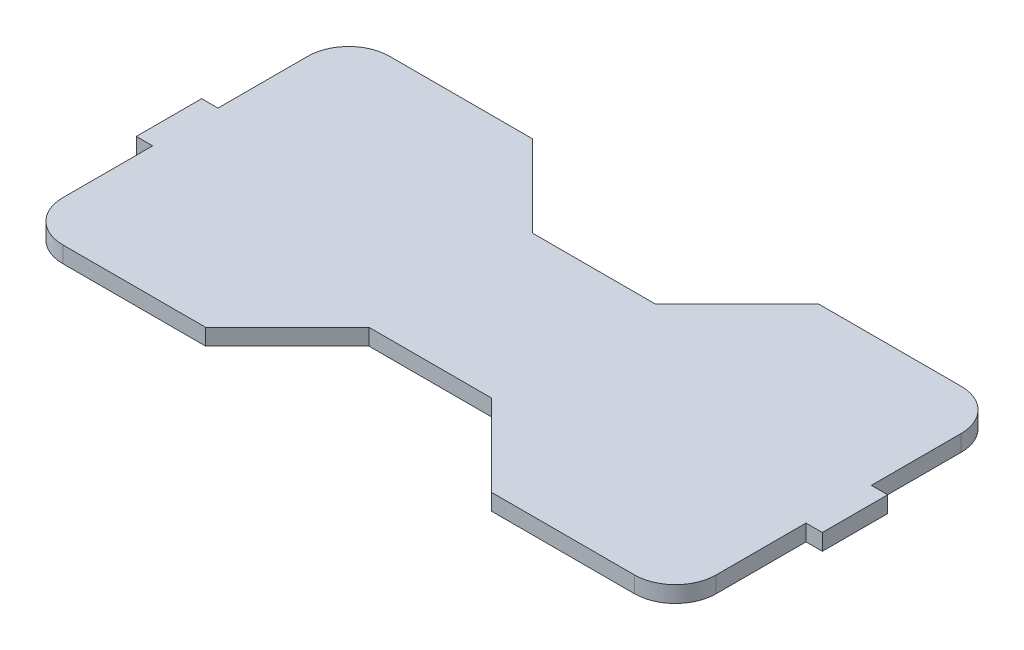
ISO-10303-21;
HEADER;
FILE_DESCRIPTION(('STEP AP214'),'2;1');
FILE_NAME('part.step','',(''),(''),'','','');
FILE_SCHEMA(('AUTOMOTIVE_DESIGN { 1 0 10303 214 1 1 1 1 }'));
ENDSEC;
DATA;
#1=APPLICATION_CONTEXT('core data for automotive mechanical design processes');
#2=APPLICATION_PROTOCOL_DEFINITION('international standard','automotive_design',2000,#1);
#3=PRODUCT_CONTEXT('',#1,'mechanical');
#4=PRODUCT('Part','Part','',(#3));
#5=PRODUCT_RELATED_PRODUCT_CATEGORY('part','',(#4));
#6=PRODUCT_DEFINITION_FORMATION('','',#4);
#7=PRODUCT_DEFINITION_CONTEXT('part definition',#1,'design');
#8=PRODUCT_DEFINITION('design','',#6,#7);
#9=PRODUCT_DEFINITION_SHAPE('','',#8);
#10=(LENGTH_UNIT() NAMED_UNIT(*) SI_UNIT(.MILLI.,.METRE.));
#11=(NAMED_UNIT(*) PLANE_ANGLE_UNIT() SI_UNIT($,.RADIAN.));
#12=(NAMED_UNIT(*) SI_UNIT($,.STERADIAN.) SOLID_ANGLE_UNIT());
#13=UNCERTAINTY_MEASURE_WITH_UNIT(LENGTH_MEASURE(1.E-05),#10,'distance_accuracy_value','');
#14=(GEOMETRIC_REPRESENTATION_CONTEXT(3) GLOBAL_UNCERTAINTY_ASSIGNED_CONTEXT((#13)) GLOBAL_UNIT_ASSIGNED_CONTEXT((#10,
#11,#12)) REPRESENTATION_CONTEXT('',''));
#15=CARTESIAN_POINT('',(0.,0.,0.));
#16=DIRECTION('',(0.,0.,1.));
#17=DIRECTION('',(1.,0.,0.));
#18=AXIS2_PLACEMENT_3D('',#15,#16,#17);
#19=CARTESIAN_POINT('',(-9.525,2.54,-12.7));
#20=DIRECTION('',(-0.707106781186549,0.,0.707106781186546));
#21=DIRECTION('',(0.707106781186546,0.,0.707106781186549));
#22=AXIS2_PLACEMENT_3D('',#19,#20,#21);
#23=PLANE('',#22);
#24=DIRECTION('',(-0.707106781186546,0.,-0.707106781186549));
#25=VECTOR('',#24,1.);
#26=CARTESIAN_POINT('',(-9.525,0.,-12.7));
#27=LINE('',#26,#25);
#28=CARTESIAN_POINT('',(-9.525,0.,-12.7));
#29=VERTEX_POINT('',#28);
#30=CARTESIAN_POINT('',(-22.225,0.,-25.4));
#31=VERTEX_POINT('',#30);
#32=EDGE_CURVE('E222',#29,#31,#27,.T.);
#33=ORIENTED_EDGE('',*,*,#32,.T.);
#34=DIRECTION('',(0.,-1.,0.));
#35=VECTOR('',#34,1.);
#36=CARTESIAN_POINT('',(-22.225,2.54,-25.4));
#37=LINE('',#36,#35);
#38=CARTESIAN_POINT('',(-22.225,2.54,-25.4));
#39=VERTEX_POINT('',#38);
#40=EDGE_CURVE('E203',#39,#31,#37,.T.);
#41=ORIENTED_EDGE('',*,*,#40,.F.);
#42=DIRECTION('',(-0.707106781186546,0.,-0.707106781186549));
#43=VECTOR('',#42,1.);
#44=CARTESIAN_POINT('',(-9.525,2.54,-12.7));
#45=LINE('',#44,#43);
#46=CARTESIAN_POINT('',(-9.525,2.54,-12.7));
#47=VERTEX_POINT('',#46);
#48=EDGE_CURVE('E209',#47,#39,#45,.T.);
#49=ORIENTED_EDGE('',*,*,#48,.F.);
#50=DIRECTION('',(0.,-1.,0.));
#51=VECTOR('',#50,1.);
#52=CARTESIAN_POINT('',(-9.525,2.54,-12.7));
#53=LINE('',#52,#51);
#54=EDGE_CURVE('E310',#47,#29,#53,.T.);
#55=ORIENTED_EDGE('',*,*,#54,.T.);
#56=EDGE_LOOP('',(#33,#41,#49,#55));
#57=FACE_BOUND('',#56,.T.);
#58=ADVANCED_FACE('F36',(#57),#23,.F.);
#59=CARTESIAN_POINT('',(-22.225,2.54,-25.4));
#60=DIRECTION('',(0.,0.,1.));
#61=DIRECTION('',(1.,0.,0.));
#62=AXIS2_PLACEMENT_3D('',#59,#60,#61);
#63=PLANE('',#62);
#64=DIRECTION('',(-1.,0.,0.));
#65=VECTOR('',#64,1.);
#66=CARTESIAN_POINT('',(-22.225,0.,-25.4));
#67=LINE('',#66,#65);
#68=CARTESIAN_POINT('',(-44.45,0.,-25.4));
#69=VERTEX_POINT('',#68);
#70=EDGE_CURVE('E362',#31,#69,#67,.T.);
#71=ORIENTED_EDGE('',*,*,#70,.T.);
#72=DIRECTION('',(0.,-1.,0.));
#73=VECTOR('',#72,1.);
#74=CARTESIAN_POINT('',(-44.45,2.54,-25.4));
#75=LINE('',#74,#73);
#76=CARTESIAN_POINT('',(-44.45,2.54,-25.4));
#77=VERTEX_POINT('',#76);
#78=EDGE_CURVE('E206',#69,#77,#75,.F.);
#79=ORIENTED_EDGE('',*,*,#78,.T.);
#80=DIRECTION('',(-1.,0.,0.));
#81=VECTOR('',#80,1.);
#82=CARTESIAN_POINT('',(-22.225,2.54,-25.4));
#83=LINE('',#82,#81);
#84=EDGE_CURVE('E198',#39,#77,#83,.T.);
#85=ORIENTED_EDGE('',*,*,#84,.F.);
#86=ORIENTED_EDGE('',*,*,#40,.T.);
#87=EDGE_LOOP('',(#71,#79,#85,#86));
#88=FACE_BOUND('',#87,.T.);
#89=ADVANCED_FACE('F201',(#88),#63,.F.);
#90=CARTESIAN_POINT('',(-50.8,2.54,-25.4));
#91=DIRECTION('',(1.,0.,0.));
#92=DIRECTION('',(0.,0.,-1.));
#93=AXIS2_PLACEMENT_3D('',#90,#91,#92);
#94=PLANE('',#93);
#95=DIRECTION('',(0.,0.,1.));
#96=VECTOR('',#95,1.);
#97=CARTESIAN_POINT('',(-50.8,2.54,-25.4));
#98=LINE('',#97,#96);
#99=CARTESIAN_POINT('',(-50.8,2.54,-19.05));
#100=VERTEX_POINT('',#99);
#101=CARTESIAN_POINT('',(-50.8,2.54,-5.07999999999999));
#102=VERTEX_POINT('',#101);
#103=EDGE_CURVE('E208',#100,#102,#98,.T.);
#104=ORIENTED_EDGE('',*,*,#103,.F.);
#105=DIRECTION('',(0.,-1.,0.));
#106=VECTOR('',#105,1.);
#107=CARTESIAN_POINT('',(-50.8,2.54,-19.05));
#108=LINE('',#107,#106);
#109=CARTESIAN_POINT('',(-50.8,0.,-19.05));
#110=VERTEX_POINT('',#109);
#111=EDGE_CURVE('E254',#100,#110,#108,.T.);
#112=ORIENTED_EDGE('',*,*,#111,.T.);
#113=DIRECTION('',(0.,0.,1.));
#114=VECTOR('',#113,1.);
#115=CARTESIAN_POINT('',(-50.8,0.,-25.4));
#116=LINE('',#115,#114);
#117=CARTESIAN_POINT('',(-50.8,0.,-5.07999999999999));
#118=VERTEX_POINT('',#117);
#119=EDGE_CURVE('E358',#110,#118,#116,.T.);
#120=ORIENTED_EDGE('',*,*,#119,.T.);
#121=DIRECTION('',(0.,-1.,0.));
#122=VECTOR('',#121,1.);
#123=CARTESIAN_POINT('',(-50.8,2.54,-5.07999999999999));
#124=LINE('',#123,#122);
#125=EDGE_CURVE('E224',#102,#118,#124,.T.);
#126=ORIENTED_EDGE('',*,*,#125,.F.);
#127=EDGE_LOOP('',(#104,#112,#120,#126));
#128=FACE_BOUND('',#127,.T.);
#129=ADVANCED_FACE('F406',(#128),#94,.F.);
#130=CARTESIAN_POINT('',(-50.8,2.54,-5.07999999999999));
#131=DIRECTION('',(0.,0.,1.));
#132=DIRECTION('',(1.,0.,0.));
#133=AXIS2_PLACEMENT_3D('',#130,#131,#132);
#134=PLANE('',#133);
#135=DIRECTION('',(-1.,0.,0.));
#136=VECTOR('',#135,1.);
#137=CARTESIAN_POINT('',(-50.8,0.,-5.07999999999999));
#138=LINE('',#137,#136);
#139=CARTESIAN_POINT('',(-53.34,0.,-5.07999999999999));
#140=VERTEX_POINT('',#139);
#141=EDGE_CURVE('E355',#118,#140,#138,.T.);
#142=ORIENTED_EDGE('',*,*,#141,.T.);
#143=DIRECTION('',(0.,-1.,0.));
#144=VECTOR('',#143,1.);
#145=CARTESIAN_POINT('',(-53.34,2.54,-5.07999999999999));
#146=LINE('',#145,#144);
#147=CARTESIAN_POINT('',(-53.34,2.54,-5.07999999999999));
#148=VERTEX_POINT('',#147);
#149=EDGE_CURVE('E230',#148,#140,#146,.T.);
#150=ORIENTED_EDGE('',*,*,#149,.F.);
#151=DIRECTION('',(-1.,0.,0.));
#152=VECTOR('',#151,1.);
#153=CARTESIAN_POINT('',(-50.8,2.54,-5.07999999999999));
#154=LINE('',#153,#152);
#155=EDGE_CURVE('E400',#102,#148,#154,.T.);
#156=ORIENTED_EDGE('',*,*,#155,.F.);
#157=ORIENTED_EDGE('',*,*,#125,.T.);
#158=EDGE_LOOP('',(#142,#150,#156,#157));
#159=FACE_BOUND('',#158,.T.);
#160=ADVANCED_FACE('F407',(#159),#134,.F.);
#161=CARTESIAN_POINT('',(-53.34,2.54,-5.07999999999999));
#162=DIRECTION('',(1.,0.,0.));
#163=DIRECTION('',(0.,0.,-1.));
#164=AXIS2_PLACEMENT_3D('',#161,#162,#163);
#165=PLANE('',#164);
#166=DIRECTION('',(0.,0.,1.));
#167=VECTOR('',#166,1.);
#168=CARTESIAN_POINT('',(-53.34,0.,-5.07999999999999));
#169=LINE('',#168,#167);
#170=CARTESIAN_POINT('',(-53.34,0.,5.07999999999999));
#171=VERTEX_POINT('',#170);
#172=EDGE_CURVE('E348',#140,#171,#169,.T.);
#173=ORIENTED_EDGE('',*,*,#172,.T.);
#174=DIRECTION('',(0.,-1.,0.));
#175=VECTOR('',#174,1.);
#176=CARTESIAN_POINT('',(-53.34,2.54,5.07999999999999));
#177=LINE('',#176,#175);
#178=CARTESIAN_POINT('',(-53.34,2.54,5.07999999999999));
#179=VERTEX_POINT('',#178);
#180=EDGE_CURVE('E339',#179,#171,#177,.T.);
#181=ORIENTED_EDGE('',*,*,#180,.F.);
#182=DIRECTION('',(0.,0.,1.));
#183=VECTOR('',#182,1.);
#184=CARTESIAN_POINT('',(-53.34,2.54,-5.07999999999999));
#185=LINE('',#184,#183);
#186=EDGE_CURVE('E350',#148,#179,#185,.T.);
#187=ORIENTED_EDGE('',*,*,#186,.F.);
#188=ORIENTED_EDGE('',*,*,#149,.T.);
#189=EDGE_LOOP('',(#173,#181,#187,#188));
#190=FACE_BOUND('',#189,.T.);
#191=ADVANCED_FACE('F346',(#190),#165,.F.);
#192=CARTESIAN_POINT('',(-50.8,2.54,5.07999999999999));
#193=DIRECTION('',(0.,0.,1.));
#194=DIRECTION('',(1.,0.,0.));
#195=AXIS2_PLACEMENT_3D('',#192,#193,#194);
#196=PLANE('',#195);
#197=DIRECTION('',(-1.,0.,0.));
#198=VECTOR('',#197,1.);
#199=CARTESIAN_POINT('',(-50.8,0.,5.07999999999999));
#200=LINE('',#199,#198);
#201=CARTESIAN_POINT('',(-50.8,0.,5.07999999999999));
#202=VERTEX_POINT('',#201);
#203=EDGE_CURVE('E281',#202,#171,#200,.T.);
#204=ORIENTED_EDGE('',*,*,#203,.F.);
#205=DIRECTION('',(0.,-1.,0.));
#206=VECTOR('',#205,1.);
#207=CARTESIAN_POINT('',(-50.8,2.54,5.07999999999999));
#208=LINE('',#207,#206);
#209=CARTESIAN_POINT('',(-50.8,2.54,5.07999999999999));
#210=VERTEX_POINT('',#209);
#211=EDGE_CURVE('E336',#210,#202,#208,.T.);
#212=ORIENTED_EDGE('',*,*,#211,.F.);
#213=DIRECTION('',(-1.,0.,0.));
#214=VECTOR('',#213,1.);
#215=CARTESIAN_POINT('',(-50.8,2.54,5.07999999999999));
#216=LINE('',#215,#214);
#217=EDGE_CURVE('E396',#210,#179,#216,.T.);
#218=ORIENTED_EDGE('',*,*,#217,.T.);
#219=ORIENTED_EDGE('',*,*,#180,.T.);
#220=EDGE_LOOP('',(#204,#212,#218,#219));
#221=FACE_BOUND('',#220,.T.);
#222=ADVANCED_FACE('F414',(#221),#196,.T.);
#223=CARTESIAN_POINT('',(-50.8,2.54,25.4));
#224=DIRECTION('',(-1.,0.,0.));
#225=DIRECTION('',(0.,0.,1.));
#226=AXIS2_PLACEMENT_3D('',#223,#224,#225);
#227=PLANE('',#226);
#228=DIRECTION('',(0.,0.,-1.));
#229=VECTOR('',#228,1.);
#230=CARTESIAN_POINT('',(-50.8,0.,25.4));
#231=LINE('',#230,#229);
#232=CARTESIAN_POINT('',(-50.8,0.,19.05));
#233=VERTEX_POINT('',#232);
#234=EDGE_CURVE('E277',#233,#202,#231,.T.);
#235=ORIENTED_EDGE('',*,*,#234,.F.);
#236=DIRECTION('',(0.,-1.,0.));
#237=VECTOR('',#236,1.);
#238=CARTESIAN_POINT('',(-50.8,2.54,19.05));
#239=LINE('',#238,#237);
#240=CARTESIAN_POINT('',(-50.8,2.54,19.05));
#241=VERTEX_POINT('',#240);
#242=EDGE_CURVE('E11',#233,#241,#239,.F.);
#243=ORIENTED_EDGE('',*,*,#242,.T.);
#244=DIRECTION('',(0.,0.,-1.));
#245=VECTOR('',#244,1.);
#246=CARTESIAN_POINT('',(-50.8,2.54,25.4));
#247=LINE('',#246,#245);
#248=EDGE_CURVE('E394',#241,#210,#247,.T.);
#249=ORIENTED_EDGE('',*,*,#248,.T.);
#250=ORIENTED_EDGE('',*,*,#211,.T.);
#251=EDGE_LOOP('',(#235,#243,#249,#250));
#252=FACE_BOUND('',#251,.T.);
#253=ADVANCED_FACE('F489',(#252),#227,.T.);
#254=CARTESIAN_POINT('',(-22.225,2.54,25.4));
#255=DIRECTION('',(0.,0.,1.));
#256=DIRECTION('',(1.,0.,0.));
#257=AXIS2_PLACEMENT_3D('',#254,#255,#256);
#258=PLANE('',#257);
#259=DIRECTION('',(-1.,0.,0.));
#260=VECTOR('',#259,1.);
#261=CARTESIAN_POINT('',(-22.225,2.54,25.4));
#262=LINE('',#261,#260);
#263=CARTESIAN_POINT('',(-22.225,2.54,25.4));
#264=VERTEX_POINT('',#263);
#265=CARTESIAN_POINT('',(-44.45,2.54,25.4));
#266=VERTEX_POINT('',#265);
#267=EDGE_CURVE('E267',#264,#266,#262,.T.);
#268=ORIENTED_EDGE('',*,*,#267,.T.);
#269=DIRECTION('',(0.,-1.,0.));
#270=VECTOR('',#269,1.);
#271=CARTESIAN_POINT('',(-44.45,2.54,25.4));
#272=LINE('',#271,#270);
#273=CARTESIAN_POINT('',(-44.45,0.,25.4));
#274=VERTEX_POINT('',#273);
#275=EDGE_CURVE('E44',#266,#274,#272,.T.);
#276=ORIENTED_EDGE('',*,*,#275,.T.);
#277=DIRECTION('',(-1.,0.,0.));
#278=VECTOR('',#277,1.);
#279=CARTESIAN_POINT('',(-22.225,0.,25.4));
#280=LINE('',#279,#278);
#281=CARTESIAN_POINT('',(-22.225,0.,25.4));
#282=VERTEX_POINT('',#281);
#283=EDGE_CURVE('E264',#282,#274,#280,.T.);
#284=ORIENTED_EDGE('',*,*,#283,.F.);
#285=DIRECTION('',(0.,-1.,0.));
#286=VECTOR('',#285,1.);
#287=CARTESIAN_POINT('',(-22.225,2.54,25.4));
#288=LINE('',#287,#286);
#289=EDGE_CURVE('E334',#264,#282,#288,.T.);
#290=ORIENTED_EDGE('',*,*,#289,.F.);
#291=EDGE_LOOP('',(#268,#276,#284,#290));
#292=FACE_BOUND('',#291,.T.);
#293=ADVANCED_FACE('F263',(#292),#258,.T.);
#294=CARTESIAN_POINT('',(-9.525,2.54,12.7));
#295=DIRECTION('',(0.707106781186549,0.,0.707106781186546));
#296=DIRECTION('',(0.707106781186546,0.,-0.707106781186549));
#297=AXIS2_PLACEMENT_3D('',#294,#295,#296);
#298=PLANE('',#297);
#299=DIRECTION('',(-0.707106781186546,0.,0.707106781186549));
#300=VECTOR('',#299,1.);
#301=CARTESIAN_POINT('',(-9.525,0.,12.7));
#302=LINE('',#301,#300);
#303=CARTESIAN_POINT('',(-9.525,0.,12.7));
#304=VERTEX_POINT('',#303);
#305=EDGE_CURVE('E276',#304,#282,#302,.T.);
#306=ORIENTED_EDGE('',*,*,#305,.F.);
#307=DIRECTION('',(0.,-1.,0.));
#308=VECTOR('',#307,1.);
#309=CARTESIAN_POINT('',(-9.525,2.54,12.7));
#310=LINE('',#309,#308);
#311=CARTESIAN_POINT('',(-9.525,2.54,12.7));
#312=VERTEX_POINT('',#311);
#313=EDGE_CURVE('E332',#312,#304,#310,.T.);
#314=ORIENTED_EDGE('',*,*,#313,.F.);
#315=DIRECTION('',(-0.707106781186546,0.,0.707106781186549));
#316=VECTOR('',#315,1.);
#317=CARTESIAN_POINT('',(-9.525,2.54,12.7));
#318=LINE('',#317,#316);
#319=EDGE_CURVE('E390',#312,#264,#318,.T.);
#320=ORIENTED_EDGE('',*,*,#319,.T.);
#321=ORIENTED_EDGE('',*,*,#289,.T.);
#322=EDGE_LOOP('',(#306,#314,#320,#321));
#323=FACE_BOUND('',#322,.T.);
#324=ADVANCED_FACE('F482',(#323),#298,.T.);
#325=CARTESIAN_POINT('',(-9.525,2.54,12.7));
#326=DIRECTION('',(0.,0.,-1.));
#327=DIRECTION('',(-1.,0.,0.));
#328=AXIS2_PLACEMENT_3D('',#325,#326,#327);
#329=PLANE('',#328);
#330=DIRECTION('',(1.,0.,0.));
#331=VECTOR('',#330,1.);
#332=CARTESIAN_POINT('',(-9.525,0.,12.7));
#333=LINE('',#332,#331);
#334=CARTESIAN_POINT('',(9.525,0.,12.7));
#335=VERTEX_POINT('',#334);
#336=EDGE_CURVE('E279',#304,#335,#333,.T.);
#337=ORIENTED_EDGE('',*,*,#336,.T.);
#338=DIRECTION('',(0.,-1.,0.));
#339=VECTOR('',#338,1.);
#340=CARTESIAN_POINT('',(9.525,2.54,12.7));
#341=LINE('',#340,#339);
#342=CARTESIAN_POINT('',(9.525,2.54,12.7));
#343=VERTEX_POINT('',#342);
#344=EDGE_CURVE('E329',#343,#335,#341,.T.);
#345=ORIENTED_EDGE('',*,*,#344,.F.);
#346=DIRECTION('',(1.,0.,0.));
#347=VECTOR('',#346,1.);
#348=CARTESIAN_POINT('',(-9.525,2.54,12.7));
#349=LINE('',#348,#347);
#350=EDGE_CURVE('E388',#312,#343,#349,.T.);
#351=ORIENTED_EDGE('',*,*,#350,.F.);
#352=ORIENTED_EDGE('',*,*,#313,.T.);
#353=EDGE_LOOP('',(#337,#345,#351,#352));
#354=FACE_BOUND('',#353,.T.);
#355=ADVANCED_FACE('F503',(#354),#329,.F.);
#356=CARTESIAN_POINT('',(9.525,2.54,12.7));
#357=DIRECTION('',(0.707106781186549,0.,-0.707106781186546));
#358=DIRECTION('',(-0.707106781186546,0.,-0.707106781186549));
#359=AXIS2_PLACEMENT_3D('',#356,#357,#358);
#360=PLANE('',#359);
#361=DIRECTION('',(0.707106781186546,0.,0.707106781186549));
#362=VECTOR('',#361,1.);
#363=CARTESIAN_POINT('',(9.525,0.,12.7));
#364=LINE('',#363,#362);
#365=CARTESIAN_POINT('',(22.225,0.,25.4));
#366=VERTEX_POINT('',#365);
#367=EDGE_CURVE('E286',#335,#366,#364,.T.);
#368=ORIENTED_EDGE('',*,*,#367,.T.);
#369=DIRECTION('',(0.,-1.,0.));
#370=VECTOR('',#369,1.);
#371=CARTESIAN_POINT('',(22.225,2.54,25.4));
#372=LINE('',#371,#370);
#373=CARTESIAN_POINT('',(22.225,2.54,25.4));
#374=VERTEX_POINT('',#373);
#375=EDGE_CURVE('E326',#374,#366,#372,.T.);
#376=ORIENTED_EDGE('',*,*,#375,.F.);
#377=DIRECTION('',(0.707106781186546,0.,0.707106781186549));
#378=VECTOR('',#377,1.);
#379=CARTESIAN_POINT('',(9.525,2.54,12.7));
#380=LINE('',#379,#378);
#381=EDGE_CURVE('E386',#343,#374,#380,.T.);
#382=ORIENTED_EDGE('',*,*,#381,.F.);
#383=ORIENTED_EDGE('',*,*,#344,.T.);
#384=EDGE_LOOP('',(#368,#376,#382,#383));
#385=FACE_BOUND('',#384,.T.);
#386=ADVANCED_FACE('F478',(#385),#360,.F.);
#387=CARTESIAN_POINT('',(22.225,2.54,25.4));
#388=DIRECTION('',(0.,0.,-1.));
#389=DIRECTION('',(-1.,0.,0.));
#390=AXIS2_PLACEMENT_3D('',#387,#388,#389);
#391=PLANE('',#390);
#392=DIRECTION('',(1.,0.,0.));
#393=VECTOR('',#392,1.);
#394=CARTESIAN_POINT('',(22.225,0.,25.4));
#395=LINE('',#394,#393);
#396=CARTESIAN_POINT('',(44.45,0.,25.4));
#397=VERTEX_POINT('',#396);
#398=EDGE_CURVE('E288',#366,#397,#395,.T.);
#399=ORIENTED_EDGE('',*,*,#398,.T.);
#400=DIRECTION('',(0.,-1.,0.));
#401=VECTOR('',#400,1.);
#402=CARTESIAN_POINT('',(44.45,2.54,25.4));
#403=LINE('',#402,#401);
#404=CARTESIAN_POINT('',(44.45,2.54,25.4));
#405=VERTEX_POINT('',#404);
#406=EDGE_CURVE('E59',#397,#405,#403,.F.);
#407=ORIENTED_EDGE('',*,*,#406,.T.);
#408=DIRECTION('',(1.,0.,0.));
#409=VECTOR('',#408,1.);
#410=CARTESIAN_POINT('',(22.225,2.54,25.4));
#411=LINE('',#410,#409);
#412=EDGE_CURVE('E384',#374,#405,#411,.T.);
#413=ORIENTED_EDGE('',*,*,#412,.F.);
#414=ORIENTED_EDGE('',*,*,#375,.T.);
#415=EDGE_LOOP('',(#399,#407,#413,#414));
#416=FACE_BOUND('',#415,.T.);
#417=ADVANCED_FACE('F474',(#416),#391,.F.);
#418=CARTESIAN_POINT('',(50.8,2.54,25.4));
#419=DIRECTION('',(-1.,0.,0.));
#420=DIRECTION('',(0.,0.,1.));
#421=AXIS2_PLACEMENT_3D('',#418,#419,#420);
#422=PLANE('',#421);
#423=DIRECTION('',(0.,0.,-1.));
#424=VECTOR('',#423,1.);
#425=CARTESIAN_POINT('',(50.8,2.54,25.4));
#426=LINE('',#425,#424);
#427=CARTESIAN_POINT('',(50.8,2.54,19.05));
#428=VERTEX_POINT('',#427);
#429=CARTESIAN_POINT('',(50.8,2.54,5.07999999999999));
#430=VERTEX_POINT('',#429);
#431=EDGE_CURVE('E382',#428,#430,#426,.T.);
#432=ORIENTED_EDGE('',*,*,#431,.F.);
#433=DIRECTION('',(0.,-1.,0.));
#434=VECTOR('',#433,1.);
#435=CARTESIAN_POINT('',(50.8,2.54,19.05));
#436=LINE('',#435,#434);
#437=CARTESIAN_POINT('',(50.8,0.,19.05));
#438=VERTEX_POINT('',#437);
#439=EDGE_CURVE('E250',#428,#438,#436,.T.);
#440=ORIENTED_EDGE('',*,*,#439,.T.);
#441=DIRECTION('',(0.,0.,-1.));
#442=VECTOR('',#441,1.);
#443=CARTESIAN_POINT('',(50.8,0.,25.4));
#444=LINE('',#443,#442);
#445=CARTESIAN_POINT('',(50.8,0.,5.07999999999999));
#446=VERTEX_POINT('',#445);
#447=EDGE_CURVE('E290',#438,#446,#444,.T.);
#448=ORIENTED_EDGE('',*,*,#447,.T.);
#449=DIRECTION('',(0.,-1.,0.));
#450=VECTOR('',#449,1.);
#451=CARTESIAN_POINT('',(50.8,2.54,5.07999999999999));
#452=LINE('',#451,#450);
#453=EDGE_CURVE('E323',#430,#446,#452,.T.);
#454=ORIENTED_EDGE('',*,*,#453,.F.);
#455=EDGE_LOOP('',(#432,#440,#448,#454));
#456=FACE_BOUND('',#455,.T.);
#457=ADVANCED_FACE('F470',(#456),#422,.F.);
#458=CARTESIAN_POINT('',(50.8,2.54,5.07999999999999));
#459=DIRECTION('',(0.,0.,-1.));
#460=DIRECTION('',(-1.,0.,0.));
#461=AXIS2_PLACEMENT_3D('',#458,#459,#460);
#462=PLANE('',#461);
#463=DIRECTION('',(1.,0.,0.));
#464=VECTOR('',#463,1.);
#465=CARTESIAN_POINT('',(50.8,0.,5.07999999999999));
#466=LINE('',#465,#464);
#467=CARTESIAN_POINT('',(53.34,0.,5.07999999999999));
#468=VERTEX_POINT('',#467);
#469=EDGE_CURVE('E292',#446,#468,#466,.T.);
#470=ORIENTED_EDGE('',*,*,#469,.T.);
#471=DIRECTION('',(0.,-1.,0.));
#472=VECTOR('',#471,1.);
#473=CARTESIAN_POINT('',(53.34,2.54,5.07999999999999));
#474=LINE('',#473,#472);
#475=CARTESIAN_POINT('',(53.34,2.54,5.07999999999999));
#476=VERTEX_POINT('',#475);
#477=EDGE_CURVE('E321',#476,#468,#474,.T.);
#478=ORIENTED_EDGE('',*,*,#477,.F.);
#479=DIRECTION('',(1.,0.,0.));
#480=VECTOR('',#479,1.);
#481=CARTESIAN_POINT('',(50.8,2.54,5.07999999999999));
#482=LINE('',#481,#480);
#483=EDGE_CURVE('E380',#430,#476,#482,.T.);
#484=ORIENTED_EDGE('',*,*,#483,.F.);
#485=ORIENTED_EDGE('',*,*,#453,.T.);
#486=EDGE_LOOP('',(#470,#478,#484,#485));
#487=FACE_BOUND('',#486,.T.);
#488=ADVANCED_FACE('F467',(#487),#462,.F.);
#489=CARTESIAN_POINT('',(53.34,2.54,-5.07999999999999));
#490=DIRECTION('',(1.,0.,0.));
#491=DIRECTION('',(0.,0.,-1.));
#492=AXIS2_PLACEMENT_3D('',#489,#490,#491);
#493=PLANE('',#492);
#494=DIRECTION('',(0.,0.,1.));
#495=VECTOR('',#494,1.);
#496=CARTESIAN_POINT('',(53.34,0.,-5.07999999999999));
#497=LINE('',#496,#495);
#498=CARTESIAN_POINT('',(53.34,0.,-5.07999999999999));
#499=VERTEX_POINT('',#498);
#500=EDGE_CURVE('E295',#499,#468,#497,.T.);
#501=ORIENTED_EDGE('',*,*,#500,.F.);
#502=DIRECTION('',(0.,-1.,0.));
#503=VECTOR('',#502,1.);
#504=CARTESIAN_POINT('',(53.34,2.54,-5.07999999999999));
#505=LINE('',#504,#503);
#506=CARTESIAN_POINT('',(53.34,2.54,-5.07999999999999));
#507=VERTEX_POINT('',#506);
#508=EDGE_CURVE('E319',#507,#499,#505,.T.);
#509=ORIENTED_EDGE('',*,*,#508,.F.);
#510=DIRECTION('',(0.,0.,1.));
#511=VECTOR('',#510,1.);
#512=CARTESIAN_POINT('',(53.34,2.54,-5.07999999999999));
#513=LINE('',#512,#511);
#514=EDGE_CURVE('E377',#507,#476,#513,.T.);
#515=ORIENTED_EDGE('',*,*,#514,.T.);
#516=ORIENTED_EDGE('',*,*,#477,.T.);
#517=EDGE_LOOP('',(#501,#509,#515,#516));
#518=FACE_BOUND('',#517,.T.);
#519=ADVANCED_FACE('F463',(#518),#493,.T.);
#520=CARTESIAN_POINT('',(50.8,2.54,-5.07999999999999));
#521=DIRECTION('',(0.,0.,-1.));
#522=DIRECTION('',(-1.,0.,0.));
#523=AXIS2_PLACEMENT_3D('',#520,#521,#522);
#524=PLANE('',#523);
#525=DIRECTION('',(1.,0.,0.));
#526=VECTOR('',#525,1.);
#527=CARTESIAN_POINT('',(50.8,0.,-5.07999999999999));
#528=LINE('',#527,#526);
#529=CARTESIAN_POINT('',(50.8,0.,-5.07999999999999));
#530=VERTEX_POINT('',#529);
#531=EDGE_CURVE('E298',#530,#499,#528,.T.);
#532=ORIENTED_EDGE('',*,*,#531,.F.);
#533=DIRECTION('',(0.,-1.,0.));
#534=VECTOR('',#533,1.);
#535=CARTESIAN_POINT('',(50.8,2.54,-5.07999999999999));
#536=LINE('',#535,#534);
#537=CARTESIAN_POINT('',(50.8,2.54,-5.07999999999999));
#538=VERTEX_POINT('',#537);
#539=EDGE_CURVE('E316',#538,#530,#536,.T.);
#540=ORIENTED_EDGE('',*,*,#539,.F.);
#541=DIRECTION('',(1.,0.,0.));
#542=VECTOR('',#541,1.);
#543=CARTESIAN_POINT('',(50.8,2.54,-5.07999999999999));
#544=LINE('',#543,#542);
#545=EDGE_CURVE('E374',#538,#507,#544,.T.);
#546=ORIENTED_EDGE('',*,*,#545,.T.);
#547=ORIENTED_EDGE('',*,*,#508,.T.);
#548=EDGE_LOOP('',(#532,#540,#546,#547));
#549=FACE_BOUND('',#548,.T.);
#550=ADVANCED_FACE('F458',(#549),#524,.T.);
#551=CARTESIAN_POINT('',(50.8,2.54,-25.4));
#552=DIRECTION('',(1.,0.,0.));
#553=DIRECTION('',(0.,0.,-1.));
#554=AXIS2_PLACEMENT_3D('',#551,#552,#553);
#555=PLANE('',#554);
#556=DIRECTION('',(0.,0.,1.));
#557=VECTOR('',#556,1.);
#558=CARTESIAN_POINT('',(50.8,0.,-25.4));
#559=LINE('',#558,#557);
#560=CARTESIAN_POINT('',(50.8,0.,-19.05));
#561=VERTEX_POINT('',#560);
#562=EDGE_CURVE('E301',#561,#530,#559,.T.);
#563=ORIENTED_EDGE('',*,*,#562,.F.);
#564=DIRECTION('',(0.,-1.,0.));
#565=VECTOR('',#564,1.);
#566=CARTESIAN_POINT('',(50.8,2.54,-19.05));
#567=LINE('',#566,#565);
#568=CARTESIAN_POINT('',(50.8,2.54,-19.05));
#569=VERTEX_POINT('',#568);
#570=EDGE_CURVE('E241',#561,#569,#567,.F.);
#571=ORIENTED_EDGE('',*,*,#570,.T.);
#572=DIRECTION('',(0.,0.,1.));
#573=VECTOR('',#572,1.);
#574=CARTESIAN_POINT('',(50.8,2.54,-25.4));
#575=LINE('',#574,#573);
#576=EDGE_CURVE('E372',#569,#538,#575,.T.);
#577=ORIENTED_EDGE('',*,*,#576,.T.);
#578=ORIENTED_EDGE('',*,*,#539,.T.);
#579=EDGE_LOOP('',(#563,#571,#577,#578));
#580=FACE_BOUND('',#579,.T.);
#581=ADVANCED_FACE('F452',(#580),#555,.T.);
#582=CARTESIAN_POINT('',(22.225,2.54,-25.4));
#583=DIRECTION('',(0.,0.,-1.));
#584=DIRECTION('',(-1.,0.,0.));
#585=AXIS2_PLACEMENT_3D('',#582,#583,#584);
#586=PLANE('',#585);
#587=DIRECTION('',(1.,0.,0.));
#588=VECTOR('',#587,1.);
#589=CARTESIAN_POINT('',(22.225,2.54,-25.4));
#590=LINE('',#589,#588);
#591=CARTESIAN_POINT('',(22.225,2.54,-25.4));
#592=VERTEX_POINT('',#591);
#593=CARTESIAN_POINT('',(44.45,2.54,-25.4));
#594=VERTEX_POINT('',#593);
#595=EDGE_CURVE('E369',#592,#594,#590,.T.);
#596=ORIENTED_EDGE('',*,*,#595,.T.);
#597=DIRECTION('',(0.,-1.,0.));
#598=VECTOR('',#597,1.);
#599=CARTESIAN_POINT('',(44.45,2.54,-25.4));
#600=LINE('',#599,#598);
#601=CARTESIAN_POINT('',(44.45,0.,-25.4));
#602=VERTEX_POINT('',#601);
#603=EDGE_CURVE('E223',#594,#602,#600,.T.);
#604=ORIENTED_EDGE('',*,*,#603,.T.);
#605=DIRECTION('',(1.,0.,0.));
#606=VECTOR('',#605,1.);
#607=CARTESIAN_POINT('',(22.225,0.,-25.4));
#608=LINE('',#607,#606);
#609=CARTESIAN_POINT('',(22.225,0.,-25.4));
#610=VERTEX_POINT('',#609);
#611=EDGE_CURVE('E303',#610,#602,#608,.T.);
#612=ORIENTED_EDGE('',*,*,#611,.F.);
#613=DIRECTION('',(0.,-1.,0.));
#614=VECTOR('',#613,1.);
#615=CARTESIAN_POINT('',(22.225,2.54,-25.4));
#616=LINE('',#615,#614);
#617=EDGE_CURVE('E314',#592,#610,#616,.T.);
#618=ORIENTED_EDGE('',*,*,#617,.F.);
#619=EDGE_LOOP('',(#596,#604,#612,#618));
#620=FACE_BOUND('',#619,.T.);
#621=ADVANCED_FACE('F446',(#620),#586,.T.);
#622=CARTESIAN_POINT('',(9.525,2.54,-12.7));
#623=DIRECTION('',(-0.707106781186549,0.,-0.707106781186546));
#624=DIRECTION('',(-0.707106781186546,0.,0.707106781186549));
#625=AXIS2_PLACEMENT_3D('',#622,#623,#624);
#626=PLANE('',#625);
#627=DIRECTION('',(0.707106781186546,0.,-0.707106781186549));
#628=VECTOR('',#627,1.);
#629=CARTESIAN_POINT('',(9.525,0.,-12.7));
#630=LINE('',#629,#628);
#631=CARTESIAN_POINT('',(9.525,0.,-12.7));
#632=VERTEX_POINT('',#631);
#633=EDGE_CURVE('E305',#632,#610,#630,.T.);
#634=ORIENTED_EDGE('',*,*,#633,.F.);
#635=DIRECTION('',(0.,-1.,0.));
#636=VECTOR('',#635,1.);
#637=CARTESIAN_POINT('',(9.525,2.54,-12.7));
#638=LINE('',#637,#636);
#639=CARTESIAN_POINT('',(9.525,2.54,-12.7));
#640=VERTEX_POINT('',#639);
#641=EDGE_CURVE('E312',#640,#632,#638,.T.);
#642=ORIENTED_EDGE('',*,*,#641,.F.);
#643=DIRECTION('',(0.707106781186546,0.,-0.707106781186549));
#644=VECTOR('',#643,1.);
#645=CARTESIAN_POINT('',(9.525,2.54,-12.7));
#646=LINE('',#645,#644);
#647=EDGE_CURVE('E366',#640,#592,#646,.T.);
#648=ORIENTED_EDGE('',*,*,#647,.T.);
#649=ORIENTED_EDGE('',*,*,#617,.T.);
#650=EDGE_LOOP('',(#634,#642,#648,#649));
#651=FACE_BOUND('',#650,.T.);
#652=ADVANCED_FACE('F442',(#651),#626,.T.);
#653=CARTESIAN_POINT('',(-9.525,2.54,-12.7));
#654=DIRECTION('',(0.,0.,-1.));
#655=DIRECTION('',(-1.,0.,0.));
#656=AXIS2_PLACEMENT_3D('',#653,#654,#655);
#657=PLANE('',#656);
#658=DIRECTION('',(1.,0.,0.));
#659=VECTOR('',#658,1.);
#660=CARTESIAN_POINT('',(-9.525,0.,-12.7));
#661=LINE('',#660,#659);
#662=EDGE_CURVE('E219',#29,#632,#661,.T.);
#663=ORIENTED_EDGE('',*,*,#662,.F.);
#664=ORIENTED_EDGE('',*,*,#54,.F.);
#665=DIRECTION('',(1.,0.,0.));
#666=VECTOR('',#665,1.);
#667=CARTESIAN_POINT('',(-9.525,2.54,-12.7));
#668=LINE('',#667,#666);
#669=EDGE_CURVE('E217',#47,#640,#668,.T.);
#670=ORIENTED_EDGE('',*,*,#669,.T.);
#671=ORIENTED_EDGE('',*,*,#641,.T.);
#672=EDGE_LOOP('',(#663,#664,#670,#671));
#673=FACE_BOUND('',#672,.T.);
#674=ADVANCED_FACE('F439',(#673),#657,.T.);
#675=CARTESIAN_POINT('',(0.,2.54,0.));
#676=DIRECTION('',(0.,1.,0.));
#677=DIRECTION('',(0.,0.,1.));
#678=AXIS2_PLACEMENT_3D('',#675,#676,#677);
#679=PLANE('',#678);
#680=ORIENTED_EDGE('',*,*,#576,.F.);
#681=CARTESIAN_POINT('',(44.45,2.54,-19.05));
#682=DIRECTION('',(0.,1.,0.));
#683=DIRECTION('',(0.,0.,1.));
#684=AXIS2_PLACEMENT_3D('',#681,#682,#683);
#685=CIRCLE('',#684,6.35);
#686=EDGE_CURVE('E248',#569,#594,#685,.T.);
#687=ORIENTED_EDGE('',*,*,#686,.T.);
#688=ORIENTED_EDGE('',*,*,#595,.F.);
#689=ORIENTED_EDGE('',*,*,#647,.F.);
#690=ORIENTED_EDGE('',*,*,#669,.F.);
#691=ORIENTED_EDGE('',*,*,#48,.T.);
#692=ORIENTED_EDGE('',*,*,#84,.T.);
#693=CARTESIAN_POINT('',(-44.45,2.54,-19.05));
#694=DIRECTION('',(0.,1.,0.));
#695=DIRECTION('',(0.,0.,1.));
#696=AXIS2_PLACEMENT_3D('',#693,#694,#695);
#697=CIRCLE('',#696,6.35);
#698=EDGE_CURVE('E245',#77,#100,#697,.T.);
#699=ORIENTED_EDGE('',*,*,#698,.T.);
#700=ORIENTED_EDGE('',*,*,#103,.T.);
#701=ORIENTED_EDGE('',*,*,#155,.T.);
#702=ORIENTED_EDGE('',*,*,#186,.T.);
#703=ORIENTED_EDGE('',*,*,#217,.F.);
#704=ORIENTED_EDGE('',*,*,#248,.F.);
#705=CARTESIAN_POINT('',(-44.45,2.54,19.05));
#706=DIRECTION('',(0.,1.,0.));
#707=DIRECTION('',(0.,0.,1.));
#708=AXIS2_PLACEMENT_3D('',#705,#706,#707);
#709=CIRCLE('',#708,6.35);
#710=EDGE_CURVE('E243',#241,#266,#709,.T.);
#711=ORIENTED_EDGE('',*,*,#710,.T.);
#712=ORIENTED_EDGE('',*,*,#267,.F.);
#713=ORIENTED_EDGE('',*,*,#319,.F.);
#714=ORIENTED_EDGE('',*,*,#350,.T.);
#715=ORIENTED_EDGE('',*,*,#381,.T.);
#716=ORIENTED_EDGE('',*,*,#412,.T.);
#717=CARTESIAN_POINT('',(44.45,2.54,19.05));
#718=DIRECTION('',(0.,1.,0.));
#719=DIRECTION('',(0.,0.,1.));
#720=AXIS2_PLACEMENT_3D('',#717,#718,#719);
#721=CIRCLE('',#720,6.35);
#722=EDGE_CURVE('E51',#405,#428,#721,.T.);
#723=ORIENTED_EDGE('',*,*,#722,.T.);
#724=ORIENTED_EDGE('',*,*,#431,.T.);
#725=ORIENTED_EDGE('',*,*,#483,.T.);
#726=ORIENTED_EDGE('',*,*,#514,.F.);
#727=ORIENTED_EDGE('',*,*,#545,.F.);
#728=EDGE_LOOP('',(#680,#687,#688,#689,#690,#691,#692,#699,#700,#701,#702,#703,#704,#711,#712,
#713,#714,#715,#716,#723,#724,#725,#726,#727));
#729=FACE_BOUND('',#728,.T.);
#730=ADVANCED_FACE('F214',(#729),#679,.T.);
#731=CARTESIAN_POINT('',(0.,0.,0.));
#732=DIRECTION('',(0.,1.,0.));
#733=DIRECTION('',(0.,0.,1.));
#734=AXIS2_PLACEMENT_3D('',#731,#732,#733);
#735=PLANE('',#734);
#736=ORIENTED_EDGE('',*,*,#611,.T.);
#737=CARTESIAN_POINT('',(44.45,0.,-19.05));
#738=DIRECTION('',(0.,1.,0.));
#739=DIRECTION('',(0.,0.,1.));
#740=AXIS2_PLACEMENT_3D('',#737,#738,#739);
#741=CIRCLE('',#740,6.35);
#742=EDGE_CURVE('E239',#602,#561,#741,.F.);
#743=ORIENTED_EDGE('',*,*,#742,.T.);
#744=ORIENTED_EDGE('',*,*,#562,.T.);
#745=ORIENTED_EDGE('',*,*,#531,.T.);
#746=ORIENTED_EDGE('',*,*,#500,.T.);
#747=ORIENTED_EDGE('',*,*,#469,.F.);
#748=ORIENTED_EDGE('',*,*,#447,.F.);
#749=CARTESIAN_POINT('',(44.45,0.,19.05));
#750=DIRECTION('',(0.,1.,0.));
#751=DIRECTION('',(0.,0.,1.));
#752=AXIS2_PLACEMENT_3D('',#749,#750,#751);
#753=CIRCLE('',#752,6.35);
#754=EDGE_CURVE('E237',#438,#397,#753,.F.);
#755=ORIENTED_EDGE('',*,*,#754,.T.);
#756=ORIENTED_EDGE('',*,*,#398,.F.);
#757=ORIENTED_EDGE('',*,*,#367,.F.);
#758=ORIENTED_EDGE('',*,*,#336,.F.);
#759=ORIENTED_EDGE('',*,*,#305,.T.);
#760=ORIENTED_EDGE('',*,*,#283,.T.);
#761=CARTESIAN_POINT('',(-44.45,0.,19.05));
#762=DIRECTION('',(0.,1.,0.));
#763=DIRECTION('',(0.,0.,1.));
#764=AXIS2_PLACEMENT_3D('',#761,#762,#763);
#765=CIRCLE('',#764,6.35);
#766=EDGE_CURVE('E227',#274,#233,#765,.F.);
#767=ORIENTED_EDGE('',*,*,#766,.T.);
#768=ORIENTED_EDGE('',*,*,#234,.T.);
#769=ORIENTED_EDGE('',*,*,#203,.T.);
#770=ORIENTED_EDGE('',*,*,#172,.F.);
#771=ORIENTED_EDGE('',*,*,#141,.F.);
#772=ORIENTED_EDGE('',*,*,#119,.F.);
#773=CARTESIAN_POINT('',(-44.45,0.,-19.05));
#774=DIRECTION('',(0.,1.,0.));
#775=DIRECTION('',(0.,0.,1.));
#776=AXIS2_PLACEMENT_3D('',#773,#774,#775);
#777=CIRCLE('',#776,6.35);
#778=EDGE_CURVE('E235',#110,#69,#777,.F.);
#779=ORIENTED_EDGE('',*,*,#778,.T.);
#780=ORIENTED_EDGE('',*,*,#70,.F.);
#781=ORIENTED_EDGE('',*,*,#32,.F.);
#782=ORIENTED_EDGE('',*,*,#662,.T.);
#783=ORIENTED_EDGE('',*,*,#633,.T.);
#784=EDGE_LOOP('',(#736,#743,#744,#745,#746,#747,#748,#755,#756,#757,#758,#759,#760,#767,#768,
#769,#770,#771,#772,#779,#780,#781,#782,#783));
#785=FACE_BOUND('',#784,.T.);
#786=ADVANCED_FACE('F272',(#785),#735,.F.);
#787=CARTESIAN_POINT('',(44.45,2.54,-19.05));
#788=DIRECTION('',(0.,-1.,0.));
#789=DIRECTION('',(0.,0.,-1.));
#790=AXIS2_PLACEMENT_3D('',#787,#788,#789);
#791=CYLINDRICAL_SURFACE('',#790,6.35);
#792=ORIENTED_EDGE('',*,*,#686,.F.);
#793=ORIENTED_EDGE('',*,*,#570,.F.);
#794=ORIENTED_EDGE('',*,*,#742,.F.);
#795=ORIENTED_EDGE('',*,*,#603,.F.);
#796=EDGE_LOOP('',(#792,#793,#794,#795));
#797=FACE_BOUND('',#796,.T.);
#798=ADVANCED_FACE('F424',(#797),#791,.T.);
#799=CARTESIAN_POINT('',(44.45,2.54,19.05));
#800=DIRECTION('',(0.,-1.,0.));
#801=DIRECTION('',(0.,0.,-1.));
#802=AXIS2_PLACEMENT_3D('',#799,#800,#801);
#803=CYLINDRICAL_SURFACE('',#802,6.35);
#804=ORIENTED_EDGE('',*,*,#722,.F.);
#805=ORIENTED_EDGE('',*,*,#406,.F.);
#806=ORIENTED_EDGE('',*,*,#754,.F.);
#807=ORIENTED_EDGE('',*,*,#439,.F.);
#808=EDGE_LOOP('',(#804,#805,#806,#807));
#809=FACE_BOUND('',#808,.T.);
#810=ADVANCED_FACE('F427',(#809),#803,.T.);
#811=CARTESIAN_POINT('',(-44.45,2.54,-19.05));
#812=DIRECTION('',(0.,-1.,0.));
#813=DIRECTION('',(0.,0.,-1.));
#814=AXIS2_PLACEMENT_3D('',#811,#812,#813);
#815=CYLINDRICAL_SURFACE('',#814,6.35);
#816=ORIENTED_EDGE('',*,*,#698,.F.);
#817=ORIENTED_EDGE('',*,*,#78,.F.);
#818=ORIENTED_EDGE('',*,*,#778,.F.);
#819=ORIENTED_EDGE('',*,*,#111,.F.);
#820=EDGE_LOOP('',(#816,#817,#818,#819));
#821=FACE_BOUND('',#820,.T.);
#822=ADVANCED_FACE('F430',(#821),#815,.T.);
#823=CARTESIAN_POINT('',(-44.45,2.54,19.05));
#824=DIRECTION('',(0.,-1.,0.));
#825=DIRECTION('',(0.,0.,-1.));
#826=AXIS2_PLACEMENT_3D('',#823,#824,#825);
#827=CYLINDRICAL_SURFACE('',#826,6.35);
#828=ORIENTED_EDGE('',*,*,#710,.F.);
#829=ORIENTED_EDGE('',*,*,#242,.F.);
#830=ORIENTED_EDGE('',*,*,#766,.F.);
#831=ORIENTED_EDGE('',*,*,#275,.F.);
#832=EDGE_LOOP('',(#828,#829,#830,#831));
#833=FACE_BOUND('',#832,.T.);
#834=ADVANCED_FACE('F38',(#833),#827,.T.);
#835=CLOSED_SHELL('',(#58,#89,#129,#160,#191,#222,#253,#293,#324,#355,#386,#417,#457,#488,#519,
#550,#581,#621,#652,#674,#730,#786,#798,#810,#822,#834));
#836=MANIFOLD_SOLID_BREP('B2',#835);
#837=ADVANCED_BREP_SHAPE_REPRESENTATION('',(#18,#836),#14);
#838=SHAPE_DEFINITION_REPRESENTATION(#9,#837);
ENDSEC;
END-ISO-10303-21;
